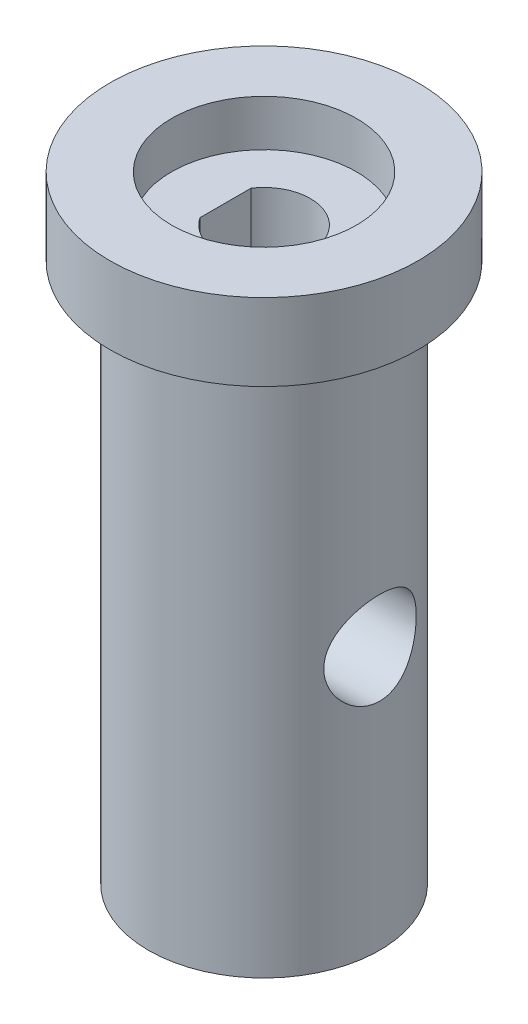
ISO-10303-21;
HEADER;
FILE_DESCRIPTION(('STEP AP214'),'2;1');
FILE_NAME('part.step','',(''),(''),'','','');
FILE_SCHEMA(('AUTOMOTIVE_DESIGN { 1 0 10303 214 1 1 1 1 }'));
ENDSEC;
DATA;
#1=APPLICATION_CONTEXT('core data for automotive mechanical design processes');
#2=APPLICATION_PROTOCOL_DEFINITION('international standard','automotive_design',2000,#1);
#3=PRODUCT_CONTEXT('',#1,'mechanical');
#4=PRODUCT('Part','Part','',(#3));
#5=PRODUCT_RELATED_PRODUCT_CATEGORY('part','',(#4));
#6=PRODUCT_DEFINITION_FORMATION('','',#4);
#7=PRODUCT_DEFINITION_CONTEXT('part definition',#1,'design');
#8=PRODUCT_DEFINITION('design','',#6,#7);
#9=PRODUCT_DEFINITION_SHAPE('','',#8);
#10=(LENGTH_UNIT() NAMED_UNIT(*) SI_UNIT(.MILLI.,.METRE.));
#11=(NAMED_UNIT(*) PLANE_ANGLE_UNIT() SI_UNIT($,.RADIAN.));
#12=(NAMED_UNIT(*) SI_UNIT($,.STERADIAN.) SOLID_ANGLE_UNIT());
#13=UNCERTAINTY_MEASURE_WITH_UNIT(LENGTH_MEASURE(1.E-05),#10,'distance_accuracy_value','');
#14=(GEOMETRIC_REPRESENTATION_CONTEXT(3) GLOBAL_UNCERTAINTY_ASSIGNED_CONTEXT((#13)) GLOBAL_UNIT_ASSIGNED_CONTEXT((#10,
#11,#12)) REPRESENTATION_CONTEXT('',''));
#15=CARTESIAN_POINT('',(0.,0.,0.));
#16=DIRECTION('',(0.,0.,1.));
#17=DIRECTION('',(1.,0.,0.));
#18=AXIS2_PLACEMENT_3D('',#15,#16,#17);
#19=CARTESIAN_POINT('',(0.,-40.,0.));
#20=DIRECTION('',(0.,1.,0.));
#21=DIRECTION('',(0.,0.,1.));
#22=AXIS2_PLACEMENT_3D('',#19,#20,#21);
#23=CYLINDRICAL_SURFACE('',#22,3.);
#24=CARTESIAN_POINT('',(0.,-23.,0.));
#25=DIRECTION('',(-0.707106781186547,0.707106781186547,0.));
#26=DIRECTION('',(0.707106781186547,0.707106781186547,0.));
#27=AXIS2_PLACEMENT_3D('',#24,#25,#26);
#28=ELLIPSE('',#27,4.24264068711929,3.);
#29=CARTESIAN_POINT('',(0.,-23.,-3.));
#30=VERTEX_POINT('',#29);
#31=CARTESIAN_POINT('',(0.,-23.,3.));
#32=VERTEX_POINT('',#31);
#33=EDGE_CURVE('E53',#30,#32,#28,.F.);
#34=ORIENTED_EDGE('',*,*,#33,.T.);
#35=CARTESIAN_POINT('',(0.,-23.,0.));
#36=DIRECTION('',(0.707106781186547,0.707106781186547,0.));
#37=DIRECTION('',(-0.707106781186547,0.707106781186547,0.));
#38=AXIS2_PLACEMENT_3D('',#35,#36,#37);
#39=ELLIPSE('',#38,4.24264068711929,3.);
#40=EDGE_CURVE('E184',#32,#30,#39,.F.);
#41=ORIENTED_EDGE('',*,*,#40,.T.);
#42=EDGE_LOOP('',(#34,#41));
#43=FACE_BOUND('',#42,.T.);
#44=CARTESIAN_POINT('',(0.,-3.,0.));
#45=DIRECTION('',(0.,1.,0.));
#46=DIRECTION('',(0.,0.,1.));
#47=AXIS2_PLACEMENT_3D('',#44,#45,#46);
#48=CIRCLE('',#47,3.);
#49=CARTESIAN_POINT('',(-2.5,-3.,-1.6583123951777));
#50=VERTEX_POINT('',#49);
#51=CARTESIAN_POINT('',(-2.5,-3.,1.6583123951777));
#52=VERTEX_POINT('',#51);
#53=EDGE_CURVE('E46',#50,#52,#48,.F.);
#54=ORIENTED_EDGE('',*,*,#53,.F.);
#55=DIRECTION('',(0.,1.,0.));
#56=VECTOR('',#55,1.);
#57=CARTESIAN_POINT('',(-2.5,-40.,-1.6583123951777));
#58=LINE('',#57,#56);
#59=CARTESIAN_POINT('',(-2.5,-12.,-1.6583123951777));
#60=VERTEX_POINT('',#59);
#61=EDGE_CURVE('E71',#60,#50,#58,.T.);
#62=ORIENTED_EDGE('',*,*,#61,.F.);
#63=CARTESIAN_POINT('',(0.,-12.,0.));
#64=DIRECTION('',(0.,-1.,0.));
#65=DIRECTION('',(0.,0.,-1.));
#66=AXIS2_PLACEMENT_3D('',#63,#64,#65);
#67=CIRCLE('',#66,3.);
#68=CARTESIAN_POINT('',(-2.5,-12.,1.6583123951777));
#69=VERTEX_POINT('',#68);
#70=EDGE_CURVE('E80',#60,#69,#67,.F.);
#71=ORIENTED_EDGE('',*,*,#70,.T.);
#72=DIRECTION('',(0.,1.,0.));
#73=VECTOR('',#72,1.);
#74=CARTESIAN_POINT('',(-2.5,-40.,1.6583123951777));
#75=LINE('',#74,#73);
#76=EDGE_CURVE('E41',#52,#69,#75,.F.);
#77=ORIENTED_EDGE('',*,*,#76,.F.);
#78=EDGE_LOOP('',(#54,#62,#71,#77));
#79=FACE_BOUND('',#78,.T.);
#80=ADVANCED_FACE('F33',(#43,#79),#23,.F.);
#81=CARTESIAN_POINT('',(-2.5,-12.,0.));
#82=DIRECTION('',(-1.,0.,0.));
#83=DIRECTION('',(0.,0.,1.));
#84=AXIS2_PLACEMENT_3D('',#81,#82,#83);
#85=PLANE('',#84);
#86=DIRECTION('',(0.,0.,-1.));
#87=VECTOR('',#86,1.);
#88=CARTESIAN_POINT('',(-2.5,-3.,0.));
#89=LINE('',#88,#87);
#90=EDGE_CURVE('E12',#52,#50,#89,.T.);
#91=ORIENTED_EDGE('',*,*,#90,.F.);
#92=ORIENTED_EDGE('',*,*,#76,.T.);
#93=DIRECTION('',(0.,0.,1.));
#94=VECTOR('',#93,1.);
#95=CARTESIAN_POINT('',(-2.5,-12.,0.));
#96=LINE('',#95,#94);
#97=EDGE_CURVE('E79',#60,#69,#96,.T.);
#98=ORIENTED_EDGE('',*,*,#97,.F.);
#99=ORIENTED_EDGE('',*,*,#61,.T.);
#100=EDGE_LOOP('',(#91,#92,#98,#99));
#101=FACE_BOUND('',#100,.T.);
#102=ADVANCED_FACE('F77',(#101),#85,.F.);
#103=CARTESIAN_POINT('',(0.,-23.,0.));
#104=DIRECTION('',(-0.707106781186547,0.707106781186547,0.));
#105=DIRECTION('',(0.707106781186547,0.707106781186547,0.));
#106=AXIS2_PLACEMENT_3D('',#103,#104,#105);
#107=ELLIPSE('',#106,4.24264068711929,3.);
#108=EDGE_CURVE('E179',#30,#32,#107,.T.);
#109=ORIENTED_EDGE('',*,*,#108,.T.);
#110=CARTESIAN_POINT('',(0.,-23.,0.));
#111=DIRECTION('',(0.707106781186547,0.707106781186547,0.));
#112=DIRECTION('',(-0.707106781186547,0.707106781186547,0.));
#113=AXIS2_PLACEMENT_3D('',#110,#111,#112);
#114=ELLIPSE('',#113,4.24264068711929,3.);
#115=EDGE_CURVE('E181',#32,#30,#114,.T.);
#116=ORIENTED_EDGE('',*,*,#115,.T.);
#117=EDGE_LOOP('',(#109,#116));
#118=FACE_BOUND('',#117,.T.);
#119=CARTESIAN_POINT('',(0.,-40.,0.));
#120=DIRECTION('',(0.,1.,0.));
#121=DIRECTION('',(0.,0.,1.));
#122=AXIS2_PLACEMENT_3D('',#119,#120,#121);
#123=CIRCLE('',#122,3.);
#124=CARTESIAN_POINT('',(0.,-40.,3.));
#125=VERTEX_POINT('',#124);
#126=EDGE_CURVE('E187',#125,#125,#123,.T.);
#127=ORIENTED_EDGE('',*,*,#126,.F.);
#128=EDGE_LOOP('',(#127));
#129=FACE_BOUND('',#128,.T.);
#130=ADVANCED_FACE('F117',(#118,#129),#23,.F.);
#131=CARTESIAN_POINT('',(0.,-40.,0.));
#132=DIRECTION('',(0.,1.,0.));
#133=DIRECTION('',(0.,0.,1.));
#134=AXIS2_PLACEMENT_3D('',#131,#132,#133);
#135=CYLINDRICAL_SURFACE('',#134,10.);
#136=CARTESIAN_POINT('',(0.,-5.,0.));
#137=DIRECTION('',(0.,1.,0.));
#138=DIRECTION('',(0.,0.,1.));
#139=AXIS2_PLACEMENT_3D('',#136,#137,#138);
#140=CIRCLE('',#139,10.);
#141=CARTESIAN_POINT('',(0.,-5.,10.));
#142=VERTEX_POINT('',#141);
#143=EDGE_CURVE('E196',#142,#142,#140,.F.);
#144=ORIENTED_EDGE('',*,*,#143,.F.);
#145=EDGE_LOOP('',(#144));
#146=FACE_BOUND('',#145,.T.);
#147=CARTESIAN_POINT('',(0.,0.,0.));
#148=DIRECTION('',(0.,1.,0.));
#149=DIRECTION('',(0.,0.,1.));
#150=AXIS2_PLACEMENT_3D('',#147,#148,#149);
#151=CIRCLE('',#150,10.);
#152=CARTESIAN_POINT('',(0.,0.,10.));
#153=VERTEX_POINT('',#152);
#154=EDGE_CURVE('E83',#153,#153,#151,.T.);
#155=ORIENTED_EDGE('',*,*,#154,.F.);
#156=EDGE_LOOP('',(#155));
#157=FACE_BOUND('',#156,.T.);
#158=ADVANCED_FACE('F35',(#146,#157),#135,.T.);
#159=CARTESIAN_POINT('',(0.,0.,0.));
#160=DIRECTION('',(0.,1.,0.));
#161=DIRECTION('',(0.,0.,1.));
#162=AXIS2_PLACEMENT_3D('',#159,#160,#161);
#163=PLANE('',#162);
#164=CARTESIAN_POINT('',(0.,0.,0.));
#165=DIRECTION('',(0.,1.,0.));
#166=DIRECTION('',(0.,0.,1.));
#167=AXIS2_PLACEMENT_3D('',#164,#165,#166);
#168=CIRCLE('',#167,6.);
#169=CARTESIAN_POINT('',(0.,0.,6.));
#170=VERTEX_POINT('',#169);
#171=EDGE_CURVE('E174',#170,#170,#168,.T.);
#172=ORIENTED_EDGE('',*,*,#171,.F.);
#173=EDGE_LOOP('',(#172));
#174=FACE_BOUND('',#173,.T.);
#175=ORIENTED_EDGE('',*,*,#154,.T.);
#176=EDGE_LOOP('',(#175));
#177=FACE_BOUND('',#176,.T.);
#178=ADVANCED_FACE('F123',(#174,#177),#163,.T.);
#179=CARTESIAN_POINT('',(0.,-5.,0.));
#180=DIRECTION('',(0.,1.,0.));
#181=DIRECTION('',(0.,0.,1.));
#182=AXIS2_PLACEMENT_3D('',#179,#180,#181);
#183=PLANE('',#182);
#184=ORIENTED_EDGE('',*,*,#143,.T.);
#185=EDGE_LOOP('',(#184));
#186=FACE_BOUND('',#185,.T.);
#187=CARTESIAN_POINT('',(0.,-5.,0.));
#188=DIRECTION('',(0.,1.,0.));
#189=DIRECTION('',(0.,0.,1.));
#190=AXIS2_PLACEMENT_3D('',#187,#188,#189);
#191=CIRCLE('',#190,7.5);
#192=CARTESIAN_POINT('',(0.,-5.,7.5));
#193=VERTEX_POINT('',#192);
#194=EDGE_CURVE('E190',#193,#193,#191,.T.);
#195=ORIENTED_EDGE('',*,*,#194,.T.);
#196=EDGE_LOOP('',(#195));
#197=FACE_BOUND('',#196,.T.);
#198=ADVANCED_FACE('F145',(#186,#197),#183,.F.);
#199=CARTESIAN_POINT('',(0.,-68.5671139599365,0.));
#200=DIRECTION('',(0.,1.,0.));
#201=DIRECTION('',(0.,0.,1.));
#202=AXIS2_PLACEMENT_3D('',#199,#200,#201);
#203=CYLINDRICAL_SURFACE('',#202,7.5);
#204=CARTESIAN_POINT('',(-6.87386354243376,-23.,-3.));
#205=CARTESIAN_POINT('',(-6.87387034169605,-23.1606855345694,-2.99999310102034));
#206=CARTESIAN_POINT('',(-6.87957650695683,-23.3216394414978,-2.9870126033011));
#207=CARTESIAN_POINT('',(-6.901666249599,-23.6389086261494,-2.93560066312235));
#208=CARTESIAN_POINT('',(-6.9180771094252,-23.7952109815078,-2.89710418548511));
#209=CARTESIAN_POINT('',(-6.95940616078833,-24.0980777134562,-2.79635331714323));
#210=CARTESIAN_POINT('',(-6.98429226391323,-24.2446763649368,-2.73418843497826));
#211=CARTESIAN_POINT('',(-7.0397201578331,-24.5253280322934,-2.58813019791228));
#212=CARTESIAN_POINT('',(-7.07026071330917,-24.6593837787862,-2.5042415873656));
#213=CARTESIAN_POINT('',(-7.13551292343503,-24.9188904718165,-2.31198302134881));
#214=CARTESIAN_POINT('',(-7.17035875533909,-25.0435345990959,-2.20256905254826));
#215=CARTESIAN_POINT('',(-7.23918686872916,-25.2732935312837,-1.96456364269823));
#216=CARTESIAN_POINT('',(-7.27316884487642,-25.3784015115646,-1.8359655281602));
#217=CARTESIAN_POINT('',(-7.33805111462092,-25.5701095854646,-1.55700947005954));
#218=CARTESIAN_POINT('',(-7.36877705418855,-25.6558164495289,-1.40599344962864));
#219=CARTESIAN_POINT('',(-7.42205891553774,-25.8002653552607,-1.09023798310296));
#220=CARTESIAN_POINT('',(-7.44461816104874,-25.8590183693733,-0.925504153615325));
#221=CARTESIAN_POINT('',(-7.47807487485913,-25.9450122289896,-0.595449640559631));
#222=CARTESIAN_POINT('',(-7.48948405155942,-25.9736409709553,-0.430543477287476));
#223=CARTESIAN_POINT('',(-7.50120466031146,-26.0030427286722,-0.0978994928759441));
#224=CARTESIAN_POINT('',(-7.50152023155834,-26.0038261339487,0.0698372487591162));
#225=CARTESIAN_POINT('',(-7.49132944230918,-25.9782758452937,0.393348742053133));
#226=CARTESIAN_POINT('',(-7.48142995157228,-25.9534628408679,0.549266179305686));
#227=CARTESIAN_POINT('',(-7.45273937203712,-25.8800106855455,0.854509663832871));
#228=CARTESIAN_POINT('',(-7.43394763082012,-25.8313697864023,1.00383522658686));
#229=CARTESIAN_POINT('',(-7.388952366862,-25.7110452756826,1.29434690776584));
#230=CARTESIAN_POINT('',(-7.36264140699335,-25.6390254277769,1.43537643506834));
#231=CARTESIAN_POINT('',(-7.30521877770412,-25.4743024896213,1.70371222611197));
#232=CARTESIAN_POINT('',(-7.27410546400724,-25.3815923103498,1.83101376407694));
#233=CARTESIAN_POINT('',(-7.20782455764184,-25.1710262960842,2.07715324198526));
#234=CARTESIAN_POINT('',(-7.17252489767638,-25.0519191611408,2.19488676789948));
#235=CARTESIAN_POINT('',(-7.10342491459894,-24.795514142252,2.40916112308898));
#236=CARTESIAN_POINT('',(-7.06962508512114,-24.6582103277066,2.50569501568047));
#237=CARTESIAN_POINT('',(-7.00645346113535,-24.3643714664391,2.67735628307891));
#238=CARTESIAN_POINT('',(-6.97723371086562,-24.207402754492,2.75180197745439));
#239=CARTESIAN_POINT('',(-6.92831385516127,-23.8816767645317,2.87276438979969));
#240=CARTESIAN_POINT('',(-6.90860756836966,-23.7129272229101,2.91929924756698));
#241=CARTESIAN_POINT('',(-6.88244639554074,-23.3794463337988,2.98043242328235));
#242=CARTESIAN_POINT('',(-6.87525549684207,-23.2150993293072,2.99680814522182));
#243=CARTESIAN_POINT('',(-6.87284246803558,-22.8858841883607,3.00234198966433));
#244=CARTESIAN_POINT('',(-6.87761670840543,-22.7210162250865,2.99150836588693));
#245=CARTESIAN_POINT('',(-6.8978406653867,-22.4053115975646,2.94454934218505));
#246=CARTESIAN_POINT('',(-6.91266686697452,-22.2542105938999,2.90989959303579));
#247=CARTESIAN_POINT('',(-6.9505507654101,-21.9600673928218,2.81820628036631));
#248=CARTESIAN_POINT('',(-6.97361028732897,-21.8170269903393,2.76115775145342));
#249=CARTESIAN_POINT('',(-7.02650672790152,-21.5365964633065,2.62370345922236));
#250=CARTESIAN_POINT('',(-7.05658056958766,-21.3996707169582,2.54244430239697));
#251=CARTESIAN_POINT('',(-7.11975577736692,-21.1407755188376,2.35974783666274));
#252=CARTESIAN_POINT('',(-7.15285837344067,-21.0188121908068,2.25830231022284));
#253=CARTESIAN_POINT('',(-7.22131373957124,-20.7839398871009,2.02926631752087));
#254=CARTESIAN_POINT('',(-7.2566521092785,-20.6723651520626,1.90029814416816));
#255=CARTESIAN_POINT('',(-7.32329691851298,-20.4722343850853,1.62462545005276));
#256=CARTESIAN_POINT('',(-7.35460319389703,-20.3836792901073,1.47792020769991));
#257=CARTESIAN_POINT('',(-7.40975573850585,-20.232428560305,1.17041990100452));
#258=CARTESIAN_POINT('',(-7.4336037936099,-20.1697267337395,1.00962822149812));
#259=CARTESIAN_POINT('',(-7.47109070203356,-20.0726767214004,0.678590386371822));
#260=CARTESIAN_POINT('',(-7.48473509559155,-20.038313147884,0.50834941541523));
#261=CARTESIAN_POINT('',(-7.49968512317788,-20.0007429475207,0.175224765543923));
#262=CARTESIAN_POINT('',(-7.50173770124618,-19.995649807157,0.0125857389781309));
#263=CARTESIAN_POINT('',(-7.49529063560582,-20.0117832190752,-0.311150753688397));
#264=CARTESIAN_POINT('',(-7.48679258923161,-20.0330057872334,-0.472248449421579));
#265=CARTESIAN_POINT('',(-7.46057270072754,-20.0998201819998,-0.783256352600094));
#266=CARTESIAN_POINT('',(-7.44314221048496,-20.1446434171348,-0.9333582057973));
#267=CARTESIAN_POINT('',(-7.40092421651037,-20.2565792088216,-1.2238835333139));
#268=CARTESIAN_POINT('',(-7.37613535594289,-20.3236958764086,-1.36430521678368));
#269=CARTESIAN_POINT('',(-7.32027141917801,-20.4816547900299,-1.63830455820773));
#270=CARTESIAN_POINT('',(-7.288966960308,-20.5734144129877,-1.77130556278107));
#271=CARTESIAN_POINT('',(-7.2238410334062,-20.7766828081205,-2.0205810602219));
#272=CARTESIAN_POINT('',(-7.19001852696379,-20.8881997544123,-2.13684859379602));
#273=CARTESIAN_POINT('',(-7.1210665105152,-21.135972720273,-2.35680182841674));
#274=CARTESIAN_POINT('',(-7.08598570842144,-21.2733328627161,-2.45926306504163));
#275=CARTESIAN_POINT('',(-7.02074485276124,-21.5644136535812,-2.63977144144724));
#276=CARTESIAN_POINT('',(-6.99058537793172,-21.7181362226803,-2.71781571083651));
#277=CARTESIAN_POINT('',(-6.94138371358595,-22.0235542797053,-2.84098572677451));
#278=CARTESIAN_POINT('',(-6.92158645020622,-22.1741924040687,-2.88843803497901));
#279=CARTESIAN_POINT('',(-6.89168739051179,-22.481733562239,-2.95907986392734));
#280=CARTESIAN_POINT('',(-6.88155858435653,-22.6386178601365,-2.98233699287412));
#281=CARTESIAN_POINT('',(-6.87587645913135,-22.8301673586673,-2.99538303278269));
#282=CARTESIAN_POINT('',(-6.87512296675926,-22.8641022205347,-2.99711296127843));
#283=CARTESIAN_POINT('',(-6.87411577084084,-22.9320207151958,-2.99942221686376));
#284=CARTESIAN_POINT('',(-6.8738621039388,-22.9660043513827,-3.0000014595918));
#285=CARTESIAN_POINT('',(-6.87386354243376,-23.,-3.));
#286=B_SPLINE_CURVE_WITH_KNOTS('',3,(#204,#205,#206,#207,#208,#209,#210,#211,#212,#213,#214,
#215,#216,#217,#218,#219,#220,#221,#222,#223,#224,#225,#226,#227,#228,#229,#230,#231,#232,#233,
#234,#235,#236,#237,#238,#239,#240,#241,#242,#243,#244,#245,#246,#247,#248,#249,#250,#251,#252,
#253,#254,#255,#256,#257,#258,#259,#260,#261,#262,#263,#264,#265,#266,#267,#268,#269,#270,#271,
#272,#273,#274,#275,#276,#277,#278,#279,#280,#281,#282,#283,#284,#285),.UNSPECIFIED.,.T.,.F.,(4,
2,2,2,2,2,2,2,2,2,2,2,2,2,2,2,2,2,2,2,2,2,2,2,2,2,2,2,2,2,2,2,2,2,2,2,2,2,2,2,4),(0.,
0.481916473151481,0.96506600373337,1.44640623494009,1.92764143235792,2.43383427426637,
2.94020361522514,3.46654003637142,3.9926620045422,4.49331274330775,4.99377667958508,
5.46612967245454,5.9385173269359,6.41802450352347,6.89769622410047,7.40886066122034,
7.92019210690691,8.44596688075886,8.97139957200152,9.4647322128663,9.95791522361909,
10.4230087212772,10.8882053797746,11.3722673197905,11.8565267178877,12.3765560137047,
12.8966064727912,13.4165323096922,13.936175639312,14.4219155963393,14.907582022689,
15.3783299166503,15.8491646674288,16.3408057670989,16.8326507484631,17.3549437992842,
17.8772982263878,18.3527499122862,18.8268694532887,18.928819278144,19.0307765770883),.UNSPECIFIED.);
#287=CARTESIAN_POINT('',(-6.87386354243376,-23.,-3.));
#288=VERTEX_POINT('',#287);
#289=EDGE_CURVE('E93',#288,#288,#286,.T.);
#290=ORIENTED_EDGE('',*,*,#289,.F.);
#291=EDGE_LOOP('',(#290));
#292=FACE_BOUND('',#291,.T.);
#293=CARTESIAN_POINT('',(6.87386354243376,-23.,-3.));
#294=CARTESIAN_POINT('',(6.87387034169605,-22.8393144654306,-2.99999310102034));
#295=CARTESIAN_POINT('',(6.87957650695683,-22.6783605585022,-2.9870126033011));
#296=CARTESIAN_POINT('',(6.901666249599,-22.3610913738506,-2.93560066312235));
#297=CARTESIAN_POINT('',(6.9180771094252,-22.2047890184922,-2.89710418548511));
#298=CARTESIAN_POINT('',(6.95940616078833,-21.9019222865438,-2.79635331714323));
#299=CARTESIAN_POINT('',(6.98429226391323,-21.7553236350632,-2.73418843497826));
#300=CARTESIAN_POINT('',(7.0397201578331,-21.4746719677066,-2.58813019791228));
#301=CARTESIAN_POINT('',(7.07026071330917,-21.3406162212138,-2.5042415873656));
#302=CARTESIAN_POINT('',(7.13551292343503,-21.0811095281835,-2.31198302134881));
#303=CARTESIAN_POINT('',(7.17035875533909,-20.9564654009041,-2.20256905254826));
#304=CARTESIAN_POINT('',(7.23918686872916,-20.7267064687163,-1.96456364269823));
#305=CARTESIAN_POINT('',(7.27316884487642,-20.6215984884354,-1.8359655281602));
#306=CARTESIAN_POINT('',(7.33805111462092,-20.4298904145354,-1.55700947005954));
#307=CARTESIAN_POINT('',(7.36877705418855,-20.3441835504711,-1.40599344962864));
#308=CARTESIAN_POINT('',(7.42205891553774,-20.1997346447393,-1.09023798310296));
#309=CARTESIAN_POINT('',(7.44461816104874,-20.1409816306267,-0.925504153615325));
#310=CARTESIAN_POINT('',(7.47807487485913,-20.0549877710104,-0.595449640559631));
#311=CARTESIAN_POINT('',(7.48948405155942,-20.0263590290447,-0.430543477287476));
#312=CARTESIAN_POINT('',(7.50120466031146,-19.9969572713278,-0.0978994928759441));
#313=CARTESIAN_POINT('',(7.50152023155834,-19.9961738660513,0.0698372487591161));
#314=CARTESIAN_POINT('',(7.49132944230918,-20.0217241547063,0.393348742053133));
#315=CARTESIAN_POINT('',(7.48142995157228,-20.0465371591321,0.549266179305685));
#316=CARTESIAN_POINT('',(7.45273937203712,-20.1199893144545,0.85450966383287));
#317=CARTESIAN_POINT('',(7.43394763082012,-20.1686302135977,1.00383522658686));
#318=CARTESIAN_POINT('',(7.388952366862,-20.2889547243174,1.29434690776584));
#319=CARTESIAN_POINT('',(7.36264140699335,-20.3609745722231,1.43537643506834));
#320=CARTESIAN_POINT('',(7.30521877770412,-20.5256975103787,1.70371222611197));
#321=CARTESIAN_POINT('',(7.27410546400724,-20.6184076896502,1.83101376407694));
#322=CARTESIAN_POINT('',(7.20782455764184,-20.8289737039158,2.07715324198526));
#323=CARTESIAN_POINT('',(7.17252489767638,-20.9480808388592,2.19488676789948));
#324=CARTESIAN_POINT('',(7.10342491459894,-21.204485857748,2.40916112308898));
#325=CARTESIAN_POINT('',(7.06962508512114,-21.3417896722934,2.50569501568047));
#326=CARTESIAN_POINT('',(7.00645346113535,-21.6356285335609,2.67735628307891));
#327=CARTESIAN_POINT('',(6.97723371086562,-21.792597245508,2.75180197745439));
#328=CARTESIAN_POINT('',(6.92831385516127,-22.1183232354683,2.87276438979969));
#329=CARTESIAN_POINT('',(6.90860756836966,-22.2870727770899,2.91929924756698));
#330=CARTESIAN_POINT('',(6.88244639554074,-22.6205536662011,2.98043242328235));
#331=CARTESIAN_POINT('',(6.87525549684207,-22.7849006706928,2.99680814522182));
#332=CARTESIAN_POINT('',(6.87284246803558,-23.1141158116393,3.00234198966433));
#333=CARTESIAN_POINT('',(6.87761670840543,-23.2789837749135,2.99150836588693));
#334=CARTESIAN_POINT('',(6.8978406653867,-23.5946884024354,2.94454934218505));
#335=CARTESIAN_POINT('',(6.91266686697452,-23.7457894061001,2.90989959303579));
#336=CARTESIAN_POINT('',(6.9505507654101,-24.0399326071782,2.81820628036631));
#337=CARTESIAN_POINT('',(6.97361028732897,-24.1829730096607,2.76115775145342));
#338=CARTESIAN_POINT('',(7.02650672790152,-24.4634035366935,2.62370345922236));
#339=CARTESIAN_POINT('',(7.05658056958766,-24.6003292830418,2.54244430239697));
#340=CARTESIAN_POINT('',(7.11975577736692,-24.8592244811624,2.35974783666274));
#341=CARTESIAN_POINT('',(7.15285837344067,-24.9811878091932,2.25830231022284));
#342=CARTESIAN_POINT('',(7.22131373957124,-25.2160601128991,2.02926631752087));
#343=CARTESIAN_POINT('',(7.2566521092785,-25.3276348479374,1.90029814416815));
#344=CARTESIAN_POINT('',(7.32329691851298,-25.5277656149147,1.62462545005276));
#345=CARTESIAN_POINT('',(7.35460319389703,-25.6163207098927,1.47792020769991));
#346=CARTESIAN_POINT('',(7.40975573850585,-25.767571439695,1.17041990100452));
#347=CARTESIAN_POINT('',(7.4336037936099,-25.8302732662605,1.00962822149812));
#348=CARTESIAN_POINT('',(7.47109070203356,-25.9273232785996,0.678590386371823));
#349=CARTESIAN_POINT('',(7.48473509559155,-25.961686852116,0.50834941541523));
#350=CARTESIAN_POINT('',(7.49968512317788,-25.9992570524793,0.175224765543923));
#351=CARTESIAN_POINT('',(7.50173770124618,-26.004350192843,0.0125857389781309));
#352=CARTESIAN_POINT('',(7.49529063560582,-25.9882167809248,-0.311150753688397));
#353=CARTESIAN_POINT('',(7.48679258923161,-25.9669942127666,-0.472248449421579));
#354=CARTESIAN_POINT('',(7.46057270072754,-25.9001798180002,-0.783256352600094));
#355=CARTESIAN_POINT('',(7.44314221048496,-25.8553565828652,-0.933358205797301));
#356=CARTESIAN_POINT('',(7.40092421651037,-25.7434207911784,-1.2238835333139));
#357=CARTESIAN_POINT('',(7.37613535594289,-25.6763041235914,-1.36430521678368));
#358=CARTESIAN_POINT('',(7.32027141917801,-25.5183452099701,-1.63830455820773));
#359=CARTESIAN_POINT('',(7.288966960308,-25.4265855870123,-1.77130556278107));
#360=CARTESIAN_POINT('',(7.2238410334062,-25.2233171918795,-2.0205810602219));
#361=CARTESIAN_POINT('',(7.19001852696379,-25.1118002455877,-2.13684859379602));
#362=CARTESIAN_POINT('',(7.1210665105152,-24.864027279727,-2.35680182841674));
#363=CARTESIAN_POINT('',(7.08598570842144,-24.7266671372839,-2.45926306504163));
#364=CARTESIAN_POINT('',(7.02074485276124,-24.4355863464188,-2.63977144144724));
#365=CARTESIAN_POINT('',(6.99058537793172,-24.2818637773197,-2.71781571083651));
#366=CARTESIAN_POINT('',(6.94138371358595,-23.9764457202947,-2.84098572677451));
#367=CARTESIAN_POINT('',(6.92158645020622,-23.8258075959313,-2.88843803497901));
#368=CARTESIAN_POINT('',(6.89168739051179,-23.518266437761,-2.95907986392734));
#369=CARTESIAN_POINT('',(6.88155858435653,-23.3613821398635,-2.98233699287412));
#370=CARTESIAN_POINT('',(6.87587645913135,-23.1698326413327,-2.99538303278269));
#371=CARTESIAN_POINT('',(6.87512296675926,-23.1358977794653,-2.99711296127843));
#372=CARTESIAN_POINT('',(6.87411577084084,-23.0679792848042,-2.99942221686376));
#373=CARTESIAN_POINT('',(6.8738621039388,-23.0339956486173,-3.0000014595918));
#374=CARTESIAN_POINT('',(6.87386354243376,-23.,-3.));
#375=B_SPLINE_CURVE_WITH_KNOTS('',3,(#293,#294,#295,#296,#297,#298,#299,#300,#301,#302,#303,
#304,#305,#306,#307,#308,#309,#310,#311,#312,#313,#314,#315,#316,#317,#318,#319,#320,#321,#322,
#323,#324,#325,#326,#327,#328,#329,#330,#331,#332,#333,#334,#335,#336,#337,#338,#339,#340,#341,
#342,#343,#344,#345,#346,#347,#348,#349,#350,#351,#352,#353,#354,#355,#356,#357,#358,#359,#360,
#361,#362,#363,#364,#365,#366,#367,#368,#369,#370,#371,#372,#373,#374),.UNSPECIFIED.,.T.,.F.,(4,
2,2,2,2,2,2,2,2,2,2,2,2,2,2,2,2,2,2,2,2,2,2,2,2,2,2,2,2,2,2,2,2,2,2,2,2,2,2,2,4),(0.,
0.481916473151481,0.96506600373337,1.44640623494009,1.92764143235792,2.43383427426637,
2.94020361522514,3.46654003637142,3.9926620045422,4.49331274330775,4.99377667958508,
5.46612967245454,5.9385173269359,6.41802450352347,6.89769622410047,7.40886066122034,
7.92019210690691,8.44596688075886,8.97139957200152,9.4647322128663,9.95791522361909,
10.4230087212772,10.8882053797746,11.3722673197905,11.8565267178877,12.3765560137047,
12.8966064727912,13.4165323096922,13.936175639312,14.4219155963393,14.907582022689,
15.3783299166503,15.8491646674288,16.3408057670989,16.8326507484631,17.3549437992842,
17.8772982263878,18.3527499122862,18.8268694532887,18.928819278144,19.0307765770883),.UNSPECIFIED.);
#376=CARTESIAN_POINT('',(6.87386354243376,-23.,-3.));
#377=VERTEX_POINT('',#376);
#378=EDGE_CURVE('E73',#377,#377,#375,.T.);
#379=ORIENTED_EDGE('',*,*,#378,.F.);
#380=EDGE_LOOP('',(#379));
#381=FACE_BOUND('',#380,.T.);
#382=CARTESIAN_POINT('',(0.,-40.,0.));
#383=DIRECTION('',(0.,1.,0.));
#384=DIRECTION('',(0.,0.,1.));
#385=AXIS2_PLACEMENT_3D('',#382,#383,#384);
#386=CIRCLE('',#385,7.5);
#387=CARTESIAN_POINT('',(0.,-40.,7.5));
#388=VERTEX_POINT('',#387);
#389=EDGE_CURVE('E193',#388,#388,#386,.F.);
#390=ORIENTED_EDGE('',*,*,#389,.F.);
#391=EDGE_LOOP('',(#390));
#392=FACE_BOUND('',#391,.T.);
#393=ORIENTED_EDGE('',*,*,#194,.F.);
#394=EDGE_LOOP('',(#393));
#395=FACE_BOUND('',#394,.T.);
#396=ADVANCED_FACE('F97',(#292,#381,#392,#395),#203,.T.);
#397=CARTESIAN_POINT('',(0.,-40.,0.));
#398=DIRECTION('',(0.,1.,0.));
#399=DIRECTION('',(0.,0.,1.));
#400=AXIS2_PLACEMENT_3D('',#397,#398,#399);
#401=PLANE('',#400);
#402=ORIENTED_EDGE('',*,*,#126,.T.);
#403=EDGE_LOOP('',(#402));
#404=FACE_BOUND('',#403,.T.);
#405=ORIENTED_EDGE('',*,*,#389,.T.);
#406=EDGE_LOOP('',(#405));
#407=FACE_BOUND('',#406,.T.);
#408=ADVANCED_FACE('F114',(#404,#407),#401,.F.);
#409=CARTESIAN_POINT('',(0.,-12.,0.));
#410=DIRECTION('',(0.,-1.,0.));
#411=DIRECTION('',(0.,0.,-1.));
#412=AXIS2_PLACEMENT_3D('',#409,#410,#411);
#413=PLANE('',#412);
#414=ORIENTED_EDGE('',*,*,#70,.F.);
#415=ORIENTED_EDGE('',*,*,#97,.T.);
#416=EDGE_LOOP('',(#414,#415));
#417=FACE_BOUND('',#416,.T.);
#418=ADVANCED_FACE('F110',(#417),#413,.T.);
#419=CARTESIAN_POINT('',(-10.,-23.,0.));
#420=DIRECTION('',(1.,0.,0.));
#421=DIRECTION('',(0.,0.,-1.));
#422=AXIS2_PLACEMENT_3D('',#419,#420,#421);
#423=CYLINDRICAL_SURFACE('',#422,3.);
#424=ORIENTED_EDGE('',*,*,#378,.T.);
#425=EDGE_LOOP('',(#424));
#426=FACE_BOUND('',#425,.T.);
#427=ORIENTED_EDGE('',*,*,#33,.F.);
#428=ORIENTED_EDGE('',*,*,#115,.F.);
#429=EDGE_LOOP('',(#427,#428));
#430=FACE_BOUND('',#429,.T.);
#431=ADVANCED_FACE('F106',(#426,#430),#423,.F.);
#432=ORIENTED_EDGE('',*,*,#289,.T.);
#433=EDGE_LOOP('',(#432));
#434=FACE_BOUND('',#433,.T.);
#435=ORIENTED_EDGE('',*,*,#108,.F.);
#436=ORIENTED_EDGE('',*,*,#40,.F.);
#437=EDGE_LOOP('',(#435,#436));
#438=FACE_BOUND('',#437,.T.);
#439=ADVANCED_FACE('F101',(#434,#438),#423,.F.);
#440=CARTESIAN_POINT('',(0.,-3.,0.));
#441=DIRECTION('',(0.,1.,0.));
#442=DIRECTION('',(0.,0.,1.));
#443=AXIS2_PLACEMENT_3D('',#440,#441,#442);
#444=PLANE('',#443);
#445=CARTESIAN_POINT('',(0.,-3.,0.));
#446=DIRECTION('',(0.,1.,0.));
#447=DIRECTION('',(0.,0.,1.));
#448=AXIS2_PLACEMENT_3D('',#445,#446,#447);
#449=CIRCLE('',#448,6.);
#450=CARTESIAN_POINT('',(0.,-3.,6.));
#451=VERTEX_POINT('',#450);
#452=EDGE_CURVE('E74',#451,#451,#449,.T.);
#453=ORIENTED_EDGE('',*,*,#452,.T.);
#454=EDGE_LOOP('',(#453));
#455=FACE_BOUND('',#454,.T.);
#456=ORIENTED_EDGE('',*,*,#53,.T.);
#457=ORIENTED_EDGE('',*,*,#90,.T.);
#458=EDGE_LOOP('',(#456,#457));
#459=FACE_BOUND('',#458,.T.);
#460=ADVANCED_FACE('F65',(#455,#459),#444,.T.);
#461=CARTESIAN_POINT('',(0.,-3.,0.));
#462=DIRECTION('',(0.,1.,0.));
#463=DIRECTION('',(0.,0.,1.));
#464=AXIS2_PLACEMENT_3D('',#461,#462,#463);
#465=CYLINDRICAL_SURFACE('',#464,6.);
#466=ORIENTED_EDGE('',*,*,#452,.F.);
#467=EDGE_LOOP('',(#466));
#468=FACE_BOUND('',#467,.T.);
#469=ORIENTED_EDGE('',*,*,#171,.T.);
#470=EDGE_LOOP('',(#469));
#471=FACE_BOUND('',#470,.T.);
#472=ADVANCED_FACE('F108',(#468,#471),#465,.F.);
#473=CLOSED_SHELL('',(#80,#102,#130,#158,#178,#198,#396,#408,#418,#431,#439,#460,#472));
#474=MANIFOLD_SOLID_BREP('B2',#473);
#475=ADVANCED_BREP_SHAPE_REPRESENTATION('',(#18,#474),#14);
#476=SHAPE_DEFINITION_REPRESENTATION(#9,#475);
ENDSEC;
END-ISO-10303-21;
